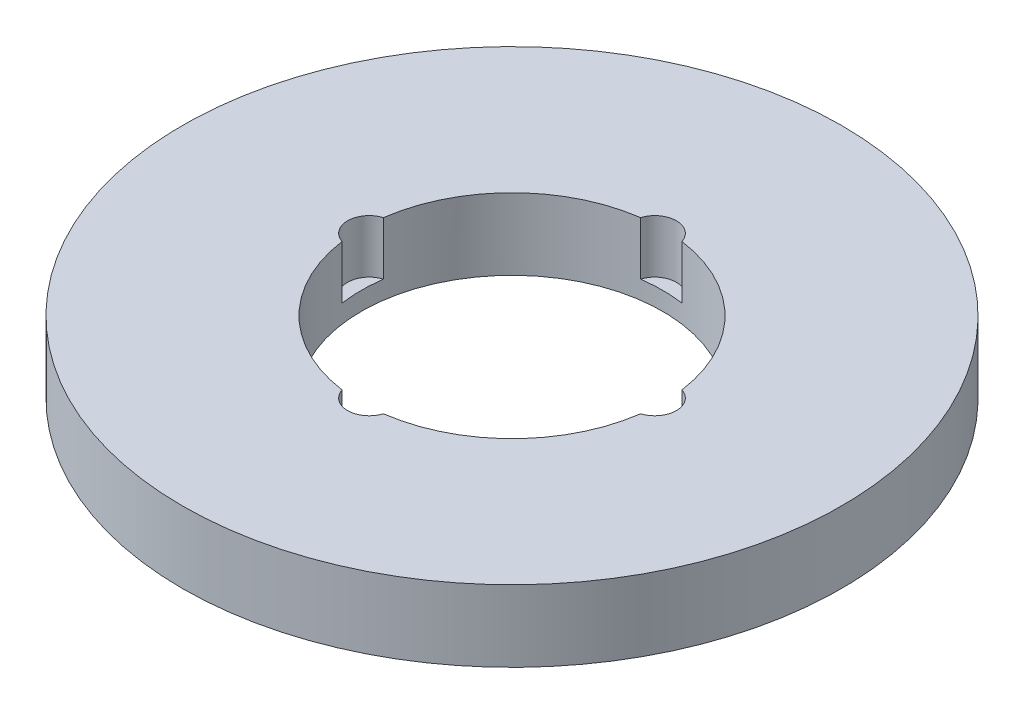
ISO-10303-21;
HEADER;
FILE_DESCRIPTION(('STEP AP214'),'2;1');
FILE_NAME('part.step','',(''),(''),'','','');
FILE_SCHEMA(('AUTOMOTIVE_DESIGN { 1 0 10303 214 1 1 1 1 }'));
ENDSEC;
DATA;
#1=APPLICATION_CONTEXT('core data for automotive mechanical design processes');
#2=APPLICATION_PROTOCOL_DEFINITION('international standard','automotive_design',2000,#1);
#3=PRODUCT_CONTEXT('',#1,'mechanical');
#4=PRODUCT('Part','Part','',(#3));
#5=PRODUCT_RELATED_PRODUCT_CATEGORY('part','',(#4));
#6=PRODUCT_DEFINITION_FORMATION('','',#4);
#7=PRODUCT_DEFINITION_CONTEXT('part definition',#1,'design');
#8=PRODUCT_DEFINITION('design','',#6,#7);
#9=PRODUCT_DEFINITION_SHAPE('','',#8);
#10=(LENGTH_UNIT() NAMED_UNIT(*) SI_UNIT(.MILLI.,.METRE.));
#11=(NAMED_UNIT(*) PLANE_ANGLE_UNIT() SI_UNIT($,.RADIAN.));
#12=(NAMED_UNIT(*) SI_UNIT($,.STERADIAN.) SOLID_ANGLE_UNIT());
#13=UNCERTAINTY_MEASURE_WITH_UNIT(LENGTH_MEASURE(1.E-05),#10,'distance_accuracy_value','');
#14=(GEOMETRIC_REPRESENTATION_CONTEXT(3) GLOBAL_UNCERTAINTY_ASSIGNED_CONTEXT((#13)) GLOBAL_UNIT_ASSIGNED_CONTEXT((#10,
#11,#12)) REPRESENTATION_CONTEXT('',''));
#15=CARTESIAN_POINT('',(0.,0.,0.));
#16=DIRECTION('',(0.,0.,1.));
#17=DIRECTION('',(1.,0.,0.));
#18=AXIS2_PLACEMENT_3D('',#15,#16,#17);
#19=CARTESIAN_POINT('',(0.,19.,0.));
#20=DIRECTION('',(0.,-1.,0.));
#21=DIRECTION('',(0.,0.,-1.));
#22=AXIS2_PLACEMENT_3D('',#19,#20,#21);
#23=CYLINDRICAL_SURFACE('',#22,87.5);
#24=CARTESIAN_POINT('',(0.,19.,0.));
#25=DIRECTION('',(0.,1.,0.));
#26=DIRECTION('',(0.,0.,1.));
#27=AXIS2_PLACEMENT_3D('',#24,#25,#26);
#28=CIRCLE('',#27,87.5);
#29=CARTESIAN_POINT('',(0.,19.,87.5));
#30=VERTEX_POINT('',#29);
#31=EDGE_CURVE('E148',#30,#30,#28,.T.);
#32=ORIENTED_EDGE('',*,*,#31,.F.);
#33=EDGE_LOOP('',(#32));
#34=FACE_BOUND('',#33,.T.);
#35=CARTESIAN_POINT('',(0.,0.,0.));
#36=DIRECTION('',(0.,1.,0.));
#37=DIRECTION('',(0.,0.,1.));
#38=AXIS2_PLACEMENT_3D('',#35,#36,#37);
#39=CIRCLE('',#38,87.5);
#40=CARTESIAN_POINT('',(0.,0.,87.5));
#41=VERTEX_POINT('',#40);
#42=EDGE_CURVE('E139',#41,#41,#39,.T.);
#43=ORIENTED_EDGE('',*,*,#42,.T.);
#44=EDGE_LOOP('',(#43));
#45=FACE_BOUND('',#44,.T.);
#46=ADVANCED_FACE('F39',(#34,#45),#23,.T.);
#47=CARTESIAN_POINT('',(0.,19.,0.));
#48=DIRECTION('',(0.,1.,0.));
#49=DIRECTION('',(0.,0.,1.));
#50=AXIS2_PLACEMENT_3D('',#47,#48,#49);
#51=PLANE('',#50);
#52=CARTESIAN_POINT('',(1.32311197269373E-13,19.,37.8954330350834));
#53=DIRECTION('',(0.,1.,0.));
#54=DIRECTION('',(1.,0.,0.));
#55=AXIS2_PLACEMENT_3D('',#52,#53,#54);
#56=CIRCLE('',#55,5.75538910567855);
#57=CARTESIAN_POINT('',(-5.49049923617894,19.,39.6213883923509));
#58=VERTEX_POINT('',#57);
#59=CARTESIAN_POINT('',(5.49049923617922,19.,39.6213883923509));
#60=VERTEX_POINT('',#59);
#61=EDGE_CURVE('E175',#58,#60,#56,.T.);
#62=ORIENTED_EDGE('',*,*,#61,.F.);
#63=CARTESIAN_POINT('',(0.,19.,0.));
#64=DIRECTION('',(0.,1.,0.));
#65=DIRECTION('',(0.,0.,1.));
#66=AXIS2_PLACEMENT_3D('',#63,#64,#65);
#67=CIRCLE('',#66,40.);
#68=CARTESIAN_POINT('',(-39.6213883923509,19.,5.49049923617908));
#69=VERTEX_POINT('',#68);
#70=EDGE_CURVE('E134',#69,#58,#67,.T.);
#71=ORIENTED_EDGE('',*,*,#70,.F.);
#72=CARTESIAN_POINT('',(-37.8954330350834,19.,0.));
#73=DIRECTION('',(0.,1.,0.));
#74=DIRECTION('',(0.,0.,1.));
#75=AXIS2_PLACEMENT_3D('',#72,#73,#74);
#76=CIRCLE('',#75,5.75538910567855);
#77=CARTESIAN_POINT('',(-39.6213883923509,19.,-5.49049923617908));
#78=VERTEX_POINT('',#77);
#79=EDGE_CURVE('E143',#78,#69,#76,.T.);
#80=ORIENTED_EDGE('',*,*,#79,.F.);
#81=CARTESIAN_POINT('',(-5.49049923617949,19.,-39.6213883923508));
#82=VERTEX_POINT('',#81);
#83=EDGE_CURVE('E123',#82,#78,#67,.T.);
#84=ORIENTED_EDGE('',*,*,#83,.F.);
#85=CARTESIAN_POINT('',(-3.9693359180812E-13,19.,-37.8954330350834));
#86=DIRECTION('',(0.,1.,0.));
#87=DIRECTION('',(-1.,0.,0.));
#88=AXIS2_PLACEMENT_3D('',#85,#86,#87);
#89=CIRCLE('',#88,5.75538910567855);
#90=CARTESIAN_POINT('',(5.49049923617866,19.,-39.6213883923509));
#91=VERTEX_POINT('',#90);
#92=EDGE_CURVE('E106',#91,#82,#89,.T.);
#93=ORIENTED_EDGE('',*,*,#92,.F.);
#94=CARTESIAN_POINT('',(39.6213883923509,19.,-5.49049923617908));
#95=VERTEX_POINT('',#94);
#96=EDGE_CURVE('E125',#95,#91,#67,.T.);
#97=ORIENTED_EDGE('',*,*,#96,.F.);
#98=CARTESIAN_POINT('',(37.8954330350834,19.,0.));
#99=DIRECTION('',(0.,1.,0.));
#100=DIRECTION('',(0.,0.,-1.));
#101=AXIS2_PLACEMENT_3D('',#98,#99,#100);
#102=CIRCLE('',#101,5.75538910567855);
#103=CARTESIAN_POINT('',(39.6213883923509,19.,5.49049923617908));
#104=VERTEX_POINT('',#103);
#105=EDGE_CURVE('E286',#104,#95,#102,.T.);
#106=ORIENTED_EDGE('',*,*,#105,.F.);
#107=EDGE_CURVE('E135',#60,#104,#67,.T.);
#108=ORIENTED_EDGE('',*,*,#107,.F.);
#109=EDGE_LOOP('',(#62,#71,#80,#84,#93,#97,#106,#108));
#110=FACE_BOUND('',#109,.T.);
#111=ORIENTED_EDGE('',*,*,#31,.T.);
#112=EDGE_LOOP('',(#111));
#113=FACE_BOUND('',#112,.T.);
#114=ADVANCED_FACE('F118',(#110,#113),#51,.T.);
#115=CARTESIAN_POINT('',(0.,0.,0.));
#116=DIRECTION('',(0.,1.,0.));
#117=DIRECTION('',(0.,0.,1.));
#118=AXIS2_PLACEMENT_3D('',#115,#116,#117);
#119=PLANE('',#118);
#120=CARTESIAN_POINT('',(0.,0.,0.));
#121=DIRECTION('',(0.,1.,0.));
#122=DIRECTION('',(0.,0.,1.));
#123=AXIS2_PLACEMENT_3D('',#120,#121,#122);
#124=CIRCLE('',#123,40.);
#125=CARTESIAN_POINT('',(0.,0.,40.));
#126=VERTEX_POINT('',#125);
#127=EDGE_CURVE('E136',#126,#126,#124,.T.);
#128=ORIENTED_EDGE('',*,*,#127,.T.);
#129=EDGE_LOOP('',(#128));
#130=FACE_BOUND('',#129,.T.);
#131=ORIENTED_EDGE('',*,*,#42,.F.);
#132=EDGE_LOOP('',(#131));
#133=FACE_BOUND('',#132,.T.);
#134=ADVANCED_FACE('F187',(#130,#133),#119,.F.);
#135=CARTESIAN_POINT('',(0.,19.,0.));
#136=DIRECTION('',(0.,-1.,0.));
#137=DIRECTION('',(0.,0.,-1.));
#138=AXIS2_PLACEMENT_3D('',#135,#136,#137);
#139=CYLINDRICAL_SURFACE('',#138,40.);
#140=DIRECTION('',(0.,1.,0.));
#141=VECTOR('',#140,1.);
#142=CARTESIAN_POINT('',(-5.49049923617894,11.9247679754279,39.6213883923509));
#143=LINE('',#142,#141);
#144=CARTESIAN_POINT('',(-5.49049923617894,4.84953595085589,39.6213883923509));
#145=VERTEX_POINT('',#144);
#146=EDGE_CURVE('E11',#145,#58,#143,.T.);
#147=ORIENTED_EDGE('',*,*,#146,.F.);
#148=CARTESIAN_POINT('',(0.,4.84953595085589,0.));
#149=DIRECTION('',(0.,1.,0.));
#150=DIRECTION('',(0.,0.,1.));
#151=AXIS2_PLACEMENT_3D('',#148,#149,#150);
#152=CIRCLE('',#151,40.);
#153=CARTESIAN_POINT('',(5.49049923617922,4.84953595085589,39.6213883923509));
#154=VERTEX_POINT('',#153);
#155=EDGE_CURVE('E170',#145,#154,#152,.T.);
#156=ORIENTED_EDGE('',*,*,#155,.T.);
#157=DIRECTION('',(0.,1.,0.));
#158=VECTOR('',#157,1.);
#159=CARTESIAN_POINT('',(5.49049923617922,11.9247679754279,39.6213883923509));
#160=LINE('',#159,#158);
#161=EDGE_CURVE('E46',#60,#154,#160,.F.);
#162=ORIENTED_EDGE('',*,*,#161,.F.);
#163=ORIENTED_EDGE('',*,*,#107,.T.);
#164=DIRECTION('',(0.,1.,0.));
#165=VECTOR('',#164,1.);
#166=CARTESIAN_POINT('',(39.6213883923509,11.9247679754279,5.49049923617908));
#167=LINE('',#166,#165);
#168=CARTESIAN_POINT('',(39.6213883923509,4.84953595085589,5.49049923617908));
#169=VERTEX_POINT('',#168);
#170=EDGE_CURVE('E164',#169,#104,#167,.T.);
#171=ORIENTED_EDGE('',*,*,#170,.F.);
#172=CARTESIAN_POINT('',(0.,4.84953595085589,0.));
#173=DIRECTION('',(0.,1.,0.));
#174=DIRECTION('',(0.,0.,1.));
#175=AXIS2_PLACEMENT_3D('',#172,#173,#174);
#176=CIRCLE('',#175,40.);
#177=CARTESIAN_POINT('',(39.6213883923509,4.84953595085589,-5.49049923617908));
#178=VERTEX_POINT('',#177);
#179=EDGE_CURVE('E115',#169,#178,#176,.T.);
#180=ORIENTED_EDGE('',*,*,#179,.T.);
#181=DIRECTION('',(0.,1.,0.));
#182=VECTOR('',#181,1.);
#183=CARTESIAN_POINT('',(39.6213883923509,11.9247679754279,-5.49049923617908));
#184=LINE('',#183,#182);
#185=EDGE_CURVE('E131',#95,#178,#184,.F.);
#186=ORIENTED_EDGE('',*,*,#185,.F.);
#187=ORIENTED_EDGE('',*,*,#96,.T.);
#188=DIRECTION('',(0.,1.,0.));
#189=VECTOR('',#188,1.);
#190=CARTESIAN_POINT('',(5.49049923617866,11.9247679754279,-39.6213883923509));
#191=LINE('',#190,#189);
#192=CARTESIAN_POINT('',(5.49049923617866,4.84953595085589,-39.6213883923509));
#193=VERTEX_POINT('',#192);
#194=EDGE_CURVE('E105',#193,#91,#191,.T.);
#195=ORIENTED_EDGE('',*,*,#194,.F.);
#196=CARTESIAN_POINT('',(0.,4.84953595085589,0.));
#197=DIRECTION('',(0.,1.,0.));
#198=DIRECTION('',(0.,0.,1.));
#199=AXIS2_PLACEMENT_3D('',#196,#197,#198);
#200=CIRCLE('',#199,40.);
#201=CARTESIAN_POINT('',(-5.49049923617949,4.84953595085589,-39.6213883923508));
#202=VERTEX_POINT('',#201);
#203=EDGE_CURVE('E159',#193,#202,#200,.T.);
#204=ORIENTED_EDGE('',*,*,#203,.T.);
#205=DIRECTION('',(0.,1.,0.));
#206=VECTOR('',#205,1.);
#207=CARTESIAN_POINT('',(-5.49049923617949,11.9247679754279,-39.6213883923508));
#208=LINE('',#207,#206);
#209=EDGE_CURVE('E114',#82,#202,#208,.F.);
#210=ORIENTED_EDGE('',*,*,#209,.F.);
#211=ORIENTED_EDGE('',*,*,#83,.T.);
#212=DIRECTION('',(0.,1.,0.));
#213=VECTOR('',#212,1.);
#214=CARTESIAN_POINT('',(-39.6213883923509,11.9247679754279,-5.49049923617908));
#215=LINE('',#214,#213);
#216=CARTESIAN_POINT('',(-39.6213883923509,4.84953595085589,-5.49049923617908));
#217=VERTEX_POINT('',#216);
#218=EDGE_CURVE('E160',#217,#78,#215,.T.);
#219=ORIENTED_EDGE('',*,*,#218,.F.);
#220=CARTESIAN_POINT('',(0.,4.84953595085589,0.));
#221=DIRECTION('',(0.,1.,0.));
#222=DIRECTION('',(0.,0.,1.));
#223=AXIS2_PLACEMENT_3D('',#220,#221,#222);
#224=CIRCLE('',#223,40.);
#225=CARTESIAN_POINT('',(-39.6213883923509,4.84953595085589,5.49049923617908));
#226=VERTEX_POINT('',#225);
#227=EDGE_CURVE('E149',#217,#226,#224,.T.);
#228=ORIENTED_EDGE('',*,*,#227,.T.);
#229=DIRECTION('',(0.,1.,0.));
#230=VECTOR('',#229,1.);
#231=CARTESIAN_POINT('',(-39.6213883923509,11.9247679754279,5.49049923617908));
#232=LINE('',#231,#230);
#233=EDGE_CURVE('E152',#69,#226,#232,.F.);
#234=ORIENTED_EDGE('',*,*,#233,.F.);
#235=ORIENTED_EDGE('',*,*,#70,.T.);
#236=EDGE_LOOP('',(#147,#156,#162,#163,#171,#180,#186,#187,#195,#204,#210,#211,#219,#228,#234,#235));
#237=FACE_BOUND('',#236,.T.);
#238=ORIENTED_EDGE('',*,*,#127,.F.);
#239=EDGE_LOOP('',(#238));
#240=FACE_BOUND('',#239,.T.);
#241=ADVANCED_FACE('F126',(#237,#240),#139,.F.);
#242=CARTESIAN_POINT('',(-37.8954330350834,4.84953595085589,0.));
#243=DIRECTION('',(0.,1.,0.));
#244=DIRECTION('',(0.,0.,1.));
#245=AXIS2_PLACEMENT_3D('',#242,#243,#244);
#246=CYLINDRICAL_SURFACE('',#245,5.75538910567855);
#247=ORIENTED_EDGE('',*,*,#218,.T.);
#248=ORIENTED_EDGE('',*,*,#79,.T.);
#249=ORIENTED_EDGE('',*,*,#233,.T.);
#250=CARTESIAN_POINT('',(-37.8954330350834,4.84953595085589,0.));
#251=DIRECTION('',(0.,1.,0.));
#252=DIRECTION('',(0.,0.,1.));
#253=AXIS2_PLACEMENT_3D('',#250,#251,#252);
#254=CIRCLE('',#253,5.75538910567855);
#255=EDGE_CURVE('E144',#217,#226,#254,.T.);
#256=ORIENTED_EDGE('',*,*,#255,.F.);
#257=EDGE_LOOP('',(#247,#248,#249,#256));
#258=FACE_BOUND('',#257,.T.);
#259=ADVANCED_FACE('F200',(#258),#246,.F.);
#260=CARTESIAN_POINT('',(-37.8954330350834,4.84953595085589,0.));
#261=DIRECTION('',(0.,1.,0.));
#262=DIRECTION('',(0.,0.,1.));
#263=AXIS2_PLACEMENT_3D('',#260,#261,#262);
#264=PLANE('',#263);
#265=ORIENTED_EDGE('',*,*,#255,.T.);
#266=ORIENTED_EDGE('',*,*,#227,.F.);
#267=EDGE_LOOP('',(#265,#266));
#268=FACE_BOUND('',#267,.T.);
#269=ADVANCED_FACE('F201',(#268),#264,.T.);
#270=CARTESIAN_POINT('',(-3.9693359180812E-13,4.84953595085589,-37.8954330350834));
#271=DIRECTION('',(0.,1.,0.));
#272=DIRECTION('',(0.,0.,1.));
#273=AXIS2_PLACEMENT_3D('',#270,#271,#272);
#274=CYLINDRICAL_SURFACE('',#273,5.75538910567855);
#275=ORIENTED_EDGE('',*,*,#194,.T.);
#276=ORIENTED_EDGE('',*,*,#92,.T.);
#277=ORIENTED_EDGE('',*,*,#209,.T.);
#278=CARTESIAN_POINT('',(-3.9693359180812E-13,4.84953595085589,-37.8954330350834));
#279=DIRECTION('',(0.,1.,0.));
#280=DIRECTION('',(-1.,0.,0.));
#281=AXIS2_PLACEMENT_3D('',#278,#279,#280);
#282=CIRCLE('',#281,5.75538910567855);
#283=EDGE_CURVE('E107',#193,#202,#282,.T.);
#284=ORIENTED_EDGE('',*,*,#283,.F.);
#285=EDGE_LOOP('',(#275,#276,#277,#284));
#286=FACE_BOUND('',#285,.T.);
#287=ADVANCED_FACE('F102',(#286),#274,.F.);
#288=CARTESIAN_POINT('',(-3.9693359180812E-13,4.84953595085589,-37.8954330350834));
#289=DIRECTION('',(0.,1.,0.));
#290=DIRECTION('',(-1.,0.,0.));
#291=AXIS2_PLACEMENT_3D('',#288,#289,#290);
#292=PLANE('',#291);
#293=ORIENTED_EDGE('',*,*,#283,.T.);
#294=ORIENTED_EDGE('',*,*,#203,.F.);
#295=EDGE_LOOP('',(#293,#294));
#296=FACE_BOUND('',#295,.T.);
#297=ADVANCED_FACE('F209',(#296),#292,.T.);
#298=CARTESIAN_POINT('',(37.8954330350834,4.84953595085589,0.));
#299=DIRECTION('',(0.,1.,0.));
#300=DIRECTION('',(0.,0.,1.));
#301=AXIS2_PLACEMENT_3D('',#298,#299,#300);
#302=CYLINDRICAL_SURFACE('',#301,5.75538910567855);
#303=ORIENTED_EDGE('',*,*,#170,.T.);
#304=ORIENTED_EDGE('',*,*,#105,.T.);
#305=ORIENTED_EDGE('',*,*,#185,.T.);
#306=CARTESIAN_POINT('',(37.8954330350834,4.84953595085589,0.));
#307=DIRECTION('',(0.,1.,0.));
#308=DIRECTION('',(0.,0.,-1.));
#309=AXIS2_PLACEMENT_3D('',#306,#307,#308);
#310=CIRCLE('',#309,5.75538910567855);
#311=EDGE_CURVE('E56',#169,#178,#310,.T.);
#312=ORIENTED_EDGE('',*,*,#311,.F.);
#313=EDGE_LOOP('',(#303,#304,#305,#312));
#314=FACE_BOUND('',#313,.T.);
#315=ADVANCED_FACE('F213',(#314),#302,.F.);
#316=CARTESIAN_POINT('',(37.8954330350834,4.84953595085589,0.));
#317=DIRECTION('',(0.,1.,0.));
#318=DIRECTION('',(0.,0.,-1.));
#319=AXIS2_PLACEMENT_3D('',#316,#317,#318);
#320=PLANE('',#319);
#321=ORIENTED_EDGE('',*,*,#311,.T.);
#322=ORIENTED_EDGE('',*,*,#179,.F.);
#323=EDGE_LOOP('',(#321,#322));
#324=FACE_BOUND('',#323,.T.);
#325=ADVANCED_FACE('F179',(#324),#320,.T.);
#326=CARTESIAN_POINT('',(1.32311197269373E-13,4.84953595085589,37.8954330350834));
#327=DIRECTION('',(0.,1.,0.));
#328=DIRECTION('',(0.,0.,1.));
#329=AXIS2_PLACEMENT_3D('',#326,#327,#328);
#330=CYLINDRICAL_SURFACE('',#329,5.75538910567855);
#331=ORIENTED_EDGE('',*,*,#146,.T.);
#332=ORIENTED_EDGE('',*,*,#61,.T.);
#333=ORIENTED_EDGE('',*,*,#161,.T.);
#334=CARTESIAN_POINT('',(1.32311197269373E-13,4.84953595085589,37.8954330350834));
#335=DIRECTION('',(0.,1.,0.));
#336=DIRECTION('',(1.,0.,0.));
#337=AXIS2_PLACEMENT_3D('',#334,#335,#336);
#338=CIRCLE('',#337,5.75538910567855);
#339=EDGE_CURVE('E55',#145,#154,#338,.T.);
#340=ORIENTED_EDGE('',*,*,#339,.F.);
#341=EDGE_LOOP('',(#331,#332,#333,#340));
#342=FACE_BOUND('',#341,.T.);
#343=ADVANCED_FACE('F171',(#342),#330,.F.);
#344=CARTESIAN_POINT('',(1.32311197269373E-13,4.84953595085589,37.8954330350834));
#345=DIRECTION('',(0.,1.,0.));
#346=DIRECTION('',(1.,0.,0.));
#347=AXIS2_PLACEMENT_3D('',#344,#345,#346);
#348=PLANE('',#347);
#349=ORIENTED_EDGE('',*,*,#339,.T.);
#350=ORIENTED_EDGE('',*,*,#155,.F.);
#351=EDGE_LOOP('',(#349,#350));
#352=FACE_BOUND('',#351,.T.);
#353=ADVANCED_FACE('F173',(#352),#348,.T.);
#354=CLOSED_SHELL('',(#46,#114,#134,#241,#259,#269,#287,#297,#315,#325,#343,#353));
#355=MANIFOLD_SOLID_BREP('B2',#354);
#356=ADVANCED_BREP_SHAPE_REPRESENTATION('',(#18,#355),#14);
#357=SHAPE_DEFINITION_REPRESENTATION(#9,#356);
ENDSEC;
END-ISO-10303-21;
